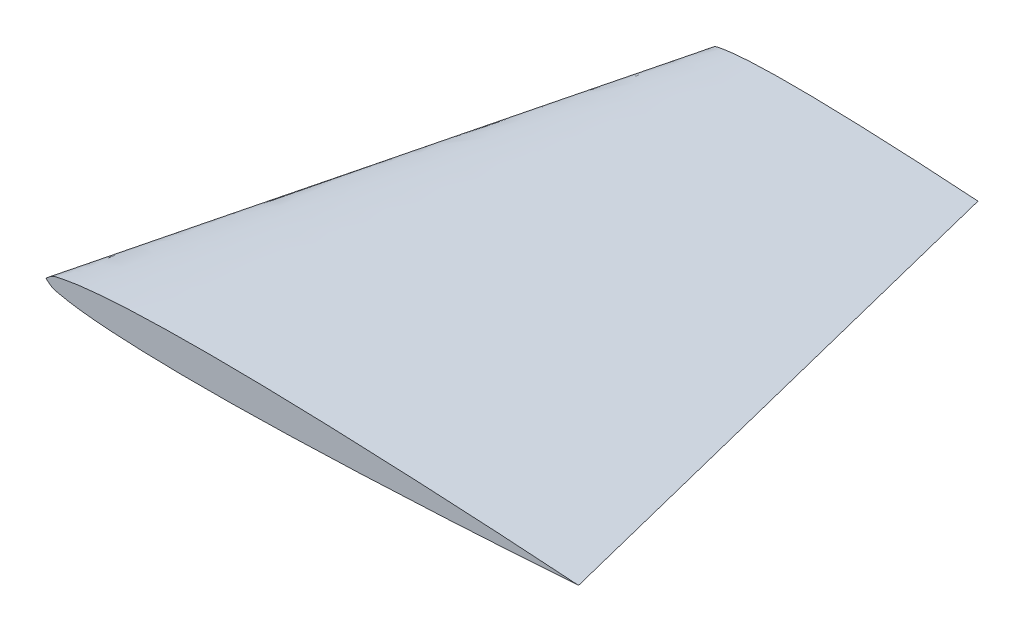
ISO-10303-21;
HEADER;
FILE_DESCRIPTION(('STEP AP214'),'2;1');
FILE_NAME('part.step','',(''),(''),'','','');
FILE_SCHEMA(('AUTOMOTIVE_DESIGN { 1 0 10303 214 1 1 1 1 }'));
ENDSEC;
DATA;
#1=APPLICATION_CONTEXT('core data for automotive mechanical design processes');
#2=APPLICATION_PROTOCOL_DEFINITION('international standard','automotive_design',2000,#1);
#3=PRODUCT_CONTEXT('',#1,'mechanical');
#4=PRODUCT('Part','Part','',(#3));
#5=PRODUCT_RELATED_PRODUCT_CATEGORY('part','',(#4));
#6=PRODUCT_DEFINITION_FORMATION('','',#4);
#7=PRODUCT_DEFINITION_CONTEXT('part definition',#1,'design');
#8=PRODUCT_DEFINITION('design','',#6,#7);
#9=PRODUCT_DEFINITION_SHAPE('','',#8);
#10=(LENGTH_UNIT() NAMED_UNIT(*) SI_UNIT(.MILLI.,.METRE.));
#11=(NAMED_UNIT(*) PLANE_ANGLE_UNIT() SI_UNIT($,.RADIAN.));
#12=(NAMED_UNIT(*) SI_UNIT($,.STERADIAN.) SOLID_ANGLE_UNIT());
#13=UNCERTAINTY_MEASURE_WITH_UNIT(LENGTH_MEASURE(1.E-05),#10,'distance_accuracy_value','');
#14=(GEOMETRIC_REPRESENTATION_CONTEXT(3) GLOBAL_UNCERTAINTY_ASSIGNED_CONTEXT((#13)) GLOBAL_UNIT_ASSIGNED_CONTEXT((#10,
#11,#12)) REPRESENTATION_CONTEXT('',''));
#15=CARTESIAN_POINT('',(0.,0.,0.));
#16=DIRECTION('',(0.,0.,1.));
#17=DIRECTION('',(1.,0.,0.));
#18=AXIS2_PLACEMENT_3D('',#15,#16,#17);
#19=CARTESIAN_POINT('',(12.6748974079118,0.340959353597855,-25.4));
#20=DIRECTION('',(0.,0.,-1.));
#21=DIRECTION('',(-1.,0.,0.));
#22=AXIS2_PLACEMENT_3D('',#19,#20,#21);
#23=PLANE('',#22);
#24=CARTESIAN_POINT('',(19.05,0.0120015,-25.4));
#25=CARTESIAN_POINT('',(18.8383446737176,0.026564659477958,-25.4));
#26=CARTESIAN_POINT('',(18.415086946658,0.0556873368407978,-25.4));
#27=CARTESIAN_POINT('',(17.1454504826109,0.136908300141959,-25.4));
#28=CARTESIAN_POINT('',(15.663846491236,0.218883802454526,-25.4));
#29=CARTESIAN_POINT('',(13.9702208806234,0.295590398675213,-25.4));
#30=CARTESIAN_POINT('',(12.7002162848019,0.342400747475957,-25.4));
#31=CARTESIAN_POINT('',(11.4301867211529,0.375783273830287,-25.4));
#32=CARTESIAN_POINT('',(10.3716840563293,0.387442448439419,-25.4));
#33=CARTESIAN_POINT('',(9.52494599929927,0.382828974564761,-25.4));
#34=CARTESIAN_POINT('',(8.889816149992,0.370294136111375,-25.4));
#35=CARTESIAN_POINT('',(8.25461654357095,0.346139204147698,-25.4));
#36=CARTESIAN_POINT('',(7.72512681650875,0.312565029501421,-25.4));
#37=CARTESIAN_POINT('',(7.30216950658663,0.271930618629846,-25.4));
#38=CARTESIAN_POINT('',(6.98277242838099,0.233618715714843,-25.4));
#39=CARTESIAN_POINT('',(6.72079803524755,0.180853938106343,-25.4));
#40=CARTESIAN_POINT('',(6.49114052756824,0.134181456566811,-25.4));
#41=CARTESIAN_POINT('',(6.39988212523975,0.0500092750214544,-25.4));
#42=CARTESIAN_POINT('',(6.35,0.0040005,-25.4));
#43=B_SPLINE_CURVE_WITH_KNOTS('',3,(#24,#25,#26,#27,#28,#29,#30,#31,#32,#33,#34,#35,#36,#37,#38,
#39,#40,#41,#42),.UNSPECIFIED.,.F.,.F.,(4,1,1,1,1,1,1,1,1,1,1,1,1,1,1,1,4),(0.,
0.0498491155189405,0.0996857660096569,0.298929011607979,0.39849819759761,0.498032959057188,
0.597533818547737,0.697007217925235,0.746742375654833,0.796486985804652,0.846259445485974,
0.896103225612024,0.92108563430274,0.946159455617349,0.971462222965117,0.984401162722593,1.),.UNSPECIFIED.);
#44=CARTESIAN_POINT('',(19.05,0.0120015,-25.4));
#45=VERTEX_POINT('',#44);
#46=CARTESIAN_POINT('',(6.35,0.0040005,-25.4));
#47=VERTEX_POINT('',#46);
#48=EDGE_CURVE('E51',#45,#47,#43,.T.);
#49=ORIENTED_EDGE('',*,*,#48,.F.);
#50=CARTESIAN_POINT('',(6.35,0.0040005,-25.4));
#51=CARTESIAN_POINT('',(6.39994005667686,-0.041945387046847,-25.4));
#52=CARTESIAN_POINT('',(6.49130444347111,-0.126002516235056,-25.4));
#53=CARTESIAN_POINT('',(6.72102057615176,-0.172385592381161,-25.4));
#54=CARTESIAN_POINT('',(6.9830612449234,-0.224820240500661,-25.4));
#55=CARTESIAN_POINT('',(7.30250634257026,-0.262729672844877,-25.4));
#56=CARTESIAN_POINT('',(7.72551451608638,-0.302831125461886,-25.4));
#57=CARTESIAN_POINT('',(8.25504612628306,-0.33573811666569,-25.4));
#58=CARTESIAN_POINT('',(8.89027566368506,-0.359092678268758,-25.4));
#59=CARTESIAN_POINT('',(9.52542080271664,-0.37082724347949,-25.4));
#60=CARTESIAN_POINT('',(10.3721640005811,-0.374373824163565,-25.4));
#61=CARTESIAN_POINT('',(11.4306511346114,-0.361380945981156,-25.4));
#62=CARTESIAN_POINT('',(12.7006376281448,-0.3263982095108,-25.4));
#63=CARTESIAN_POINT('',(13.9705822348209,-0.277987692712483,-25.4));
#64=CARTESIAN_POINT('',(15.6641098507613,-0.199147189959067,-25.4));
#65=CARTESIAN_POINT('',(17.1456093769475,-0.115304932430437,-25.4));
#66=CARTESIAN_POINT('',(18.4151424947843,-0.0324842922926891,-25.4));
#67=CARTESIAN_POINT('',(18.8383631913032,-0.00282833352299483,-25.4));
#68=CARTESIAN_POINT('',(19.05,0.0120015,-25.4));
#69=B_SPLINE_CURVE_WITH_KNOTS('',3,(#50,#51,#52,#53,#54,#55,#56,#57,#58,#59,#60,#61,#62,#63,#64,
#65,#66,#67,#68),.UNSPECIFIED.,.F.,.F.,(4,1,1,1,1,1,1,1,1,1,1,1,1,1,1,1,4),(0.,
0.0155988372774071,0.0285377770348835,0.0538405443826511,0.07891436569726,0.103896774387976,
0.153740554514026,0.203513014195348,0.253257624345167,0.302992782074765,0.402466181452263,
0.501967040942812,0.60150180240239,0.701070988392021,0.900314233990343,0.950150884481059,1.),.UNSPECIFIED.);
#70=EDGE_CURVE('E11',#47,#45,#69,.T.);
#71=ORIENTED_EDGE('',*,*,#70,.F.);
#72=EDGE_LOOP('',(#49,#71));
#73=FACE_BOUND('',#72,.T.);
#74=ADVANCED_FACE('F41',(#73),#23,.T.);
#75=CARTESIAN_POINT('',(12.6506339103945,-0.657978437098193,0.));
#76=DIRECTION('',(0.,0.,1.));
#77=DIRECTION('',(1.,0.,0.));
#78=AXIS2_PLACEMENT_3D('',#75,#76,#77);
#79=PLANE('',#78);
#80=CARTESIAN_POINT('',(0.,0.,0.));
#81=CARTESIAN_POINT('',(0.0998801133537167,-0.0918917740936939,0.));
#82=CARTESIAN_POINT('',(0.282608886942222,-0.260006032470112,0.));
#83=CARTESIAN_POINT('',(0.742041152303517,-0.352772184762323,0.));
#84=CARTESIAN_POINT('',(1.26612248984681,-0.457641481001323,0.));
#85=CARTESIAN_POINT('',(1.90501268514052,-0.533460345689754,0.));
#86=CARTESIAN_POINT('',(2.75102903217276,-0.613663250923771,0.));
#87=CARTESIAN_POINT('',(3.81009225256612,-0.67947723333138,0.));
#88=CARTESIAN_POINT('',(5.08055132737012,-0.726186356537516,0.));
#89=CARTESIAN_POINT('',(6.35084160543328,-0.749655486958981,0.));
#90=CARTESIAN_POINT('',(8.04432800116212,-0.756748648327131,0.));
#91=CARTESIAN_POINT('',(10.1613022692228,-0.730762891962312,0.));
#92=CARTESIAN_POINT('',(12.7012752562895,-0.660797419021601,0.));
#93=CARTESIAN_POINT('',(15.2411644696419,-0.563976385424965,0.));
#94=CARTESIAN_POINT('',(17.7810007262782,-0.445736821156993,0.));
#95=CARTESIAN_POINT('',(20.3208837788568,-0.310494645980327,0.));
#96=CARTESIAN_POINT('',(22.4372336618177,-0.183419318255436,0.));
#97=CARTESIAN_POINT('',(24.1302849895687,-0.0729695845853782,0.));
#98=CARTESIAN_POINT('',(24.9767263826065,-0.0136576670459897,0.));
#99=CARTESIAN_POINT('',(25.4,0.016002,0.));
#100=B_SPLINE_CURVE_WITH_KNOTS('',3,(#80,#81,#82,#83,#84,#85,#86,#87,#88,#89,#90,#91,#92,#93,
#94,#95,#96,#97,#98,#99),.UNSPECIFIED.,.F.,.F.,(4,1,1,1,1,1,1,1,1,1,1,1,1,1,1,1,1,4),(0.,
0.0155988372774071,0.0285377770348835,0.0538405443826511,0.07891436569726,0.103896774387976,
0.153740554514026,0.203513014195348,0.253257624345167,0.302992782074765,0.402466181452263,
0.501967040942812,0.60150180240239,0.701070988392021,0.800673904092982,0.900314233990343,
0.950150884481059,1.),.UNSPECIFIED.);
#101=CARTESIAN_POINT('',(0.,0.,0.));
#102=VERTEX_POINT('',#101);
#103=CARTESIAN_POINT('',(25.4,0.016002,0.));
#104=VERTEX_POINT('',#103);
#105=EDGE_CURVE('E72',#102,#104,#100,.T.);
#106=ORIENTED_EDGE('',*,*,#105,.T.);
#107=CARTESIAN_POINT('',(25.4,0.016002,0.));
#108=CARTESIAN_POINT('',(24.9766893474353,0.045128318955916,0.));
#109=CARTESIAN_POINT('',(24.130173893316,0.103373673681596,0.));
#110=CARTESIAN_POINT('',(22.4369847428994,0.211690075850408,0.));
#111=CARTESIAN_POINT('',(20.320476425047,0.336098702908787,0.));
#112=CARTESIAN_POINT('',(17.7804249835537,0.468140519354187,0.));
#113=CARTESIAN_POINT('',(15.2404417612467,0.583179797350425,0.));
#114=CARTESIAN_POINT('',(12.7004325696037,0.676800494951913,0.));
#115=CARTESIAN_POINT('',(10.1603734423059,0.743565547660575,0.));
#116=CARTESIAN_POINT('',(8.04336811265864,0.766883896878838,0.));
#117=CARTESIAN_POINT('',(6.34989199859855,0.757656949129521,0.));
#118=CARTESIAN_POINT('',(5.079632299984,0.732587272222749,0.));
#119=CARTESIAN_POINT('',(3.8092330871419,0.684277408295396,0.));
#120=CARTESIAN_POINT('',(2.75025363301751,0.617129059002841,0.));
#121=CARTESIAN_POINT('',(1.90433901317326,0.535860237259691,0.));
#122=CARTESIAN_POINT('',(1.26554485676197,0.459236431429686,0.));
#123=CARTESIAN_POINT('',(0.741596070495102,0.353706876212686,0.));
#124=CARTESIAN_POINT('',(0.282281055136491,0.260361913133622,0.));
#125=CARTESIAN_POINT('',(0.0997642504795106,0.0920175500429088,0.));
#126=CARTESIAN_POINT('',(0.,0.,0.));
#127=B_SPLINE_CURVE_WITH_KNOTS('',3,(#107,#108,#109,#110,#111,#112,#113,#114,#115,#116,#117,
#118,#119,#120,#121,#122,#123,#124,#125,#126),.UNSPECIFIED.,.F.,.F.,(4,1,1,1,1,1,1,1,1,1,1,1,1,
1,1,1,1,4),(0.,0.0498491155189405,0.0996857660096569,0.199326095907018,0.298929011607979,
0.39849819759761,0.498032959057188,0.597533818547737,0.697007217925235,0.746742375654833,
0.796486985804652,0.846259445485974,0.896103225612024,0.92108563430274,0.946159455617349,
0.971462222965117,0.984401162722593,1.),.UNSPECIFIED.);
#128=EDGE_CURVE('E76',#104,#102,#127,.T.);
#129=ORIENTED_EDGE('',*,*,#128,.T.);
#130=EDGE_LOOP('',(#106,#129));
#131=FACE_BOUND('',#130,.T.);
#132=ADVANCED_FACE('F82',(#131),#79,.T.);
#133=CARTESIAN_POINT('',(25.4,0.016002,0.));
#134=CARTESIAN_POINT('',(19.05,0.0120015,-25.4));
#135=CARTESIAN_POINT('',(24.9767263826065,-0.0136576670459897,0.));
#136=CARTESIAN_POINT('',(18.8383631913032,-0.00282833352299483,-25.4));
#137=CARTESIAN_POINT('',(24.1302849895687,-0.0729695845853782,0.));
#138=CARTESIAN_POINT('',(18.4151424947843,-0.0324842922926891,-25.4));
#139=CARTESIAN_POINT('',(22.4372336618177,-0.183419318255436,0.));
#140=CARTESIAN_POINT('',(17.5686168309088,-0.0877091591277181,-25.4));
#141=CARTESIAN_POINT('',(20.3208837788568,-0.310494645980327,0.));
#142=CARTESIAN_POINT('',(16.5104432830046,-0.151250782078398,-25.4));
#143=CARTESIAN_POINT('',(17.7810007262782,-0.445736821156993,0.));
#144=CARTESIAN_POINT('',(15.2405003631391,-0.218867910578496,-25.4));
#145=CARTESIAN_POINT('',(15.2411644696419,-0.563976385424965,0.));
#146=CARTESIAN_POINT('',(13.9705822348209,-0.277987692712483,-25.4));
#147=CARTESIAN_POINT('',(12.7012752562895,-0.660797419021601,0.));
#148=CARTESIAN_POINT('',(12.7006376281448,-0.3263982095108,-25.4));
#149=CARTESIAN_POINT('',(10.1613022692228,-0.730762891962312,0.));
#150=CARTESIAN_POINT('',(11.4306511346114,-0.361380945981156,-25.4));
#151=CARTESIAN_POINT('',(8.04432800116212,-0.756748648327131,0.));
#152=CARTESIAN_POINT('',(10.3721640005811,-0.374373824163565,-25.4));
#153=CARTESIAN_POINT('',(6.35084160543328,-0.749655486958981,0.));
#154=CARTESIAN_POINT('',(9.52542080271664,-0.37082724347949,-25.4));
#155=CARTESIAN_POINT('',(5.08055132737012,-0.726186356537516,0.));
#156=CARTESIAN_POINT('',(8.89027566368506,-0.359092678268758,-25.4));
#157=CARTESIAN_POINT('',(3.81009225256612,-0.67947723333138,0.));
#158=CARTESIAN_POINT('',(8.25504612628306,-0.33573811666569,-25.4));
#159=CARTESIAN_POINT('',(2.75102903217276,-0.613663250923771,0.));
#160=CARTESIAN_POINT('',(7.72551451608638,-0.302831125461886,-25.4));
#161=CARTESIAN_POINT('',(1.90501268514052,-0.533460345689754,0.));
#162=CARTESIAN_POINT('',(7.30250634257026,-0.262729672844877,-25.4));
#163=CARTESIAN_POINT('',(1.26612248984681,-0.457641481001323,0.));
#164=CARTESIAN_POINT('',(6.9830612449234,-0.224820240500661,-25.4));
#165=CARTESIAN_POINT('',(0.742041152303517,-0.352772184762323,0.));
#166=CARTESIAN_POINT('',(6.72102057615176,-0.172385592381161,-25.4));
#167=CARTESIAN_POINT('',(0.282608886942222,-0.260006032470112,0.));
#168=CARTESIAN_POINT('',(6.49130444347111,-0.126002516235056,-25.4));
#169=CARTESIAN_POINT('',(0.0998801133537167,-0.0918917740936939,0.));
#170=CARTESIAN_POINT('',(6.39994005667686,-0.041945387046847,-25.4));
#171=CARTESIAN_POINT('',(0.,0.,0.));
#172=CARTESIAN_POINT('',(6.35,0.0040005,-25.4));
#173=B_SPLINE_SURFACE_WITH_KNOTS('',3,1,((#133,#134),(#135,#136),(#137,#138),(#139,#140),(#141,
#142),(#143,#144),(#145,#146),(#147,#148),(#149,#150),(#151,#152),(#153,#154),(#155,#156),(#157,
#158),(#159,#160),(#161,#162),(#163,#164),(#165,#166),(#167,#168),(#169,#170),(#171,#172)),
.UNSPECIFIED.,.F.,.F.,.F.,(4,1,1,1,1,1,1,1,1,1,1,1,1,1,1,1,1,4),(2,2),(0.,0.0498491155189406,
0.0996857660096568,0.199326095907018,0.298929011607979,0.39849819759761,0.498032959057188,
0.597533818547737,0.697007217925235,0.746742375654833,0.796486985804652,0.846259445485974,
0.896103225612024,0.92108563430274,0.946159455617349,0.971462222965117,0.984401162722593,1.),
(0.,1.),.UNSPECIFIED.);
#174=DIRECTION('',(0.242535622205086,0.000152797441989204,-0.970142488820345));
#175=VECTOR('',#174,1.);
#176=CARTESIAN_POINT('',(3.175,0.00200025,-12.7));
#177=LINE('',#176,#175);
#178=EDGE_CURVE('E75',#102,#47,#177,.T.);
#179=DIRECTION('',(0.242535622205086,0.000152797441989204,0.970142488820345));
#180=VECTOR('',#179,1.);
#181=CARTESIAN_POINT('',(22.225,0.01400175,-12.7));
#182=LINE('',#181,#180);
#183=EDGE_CURVE('E62',#45,#104,#182,.T.);
#184=ORIENTED_EDGE('',*,*,#105,.F.);
#185=ORIENTED_EDGE('',*,*,#178,.T.);
#186=ORIENTED_EDGE('',*,*,#70,.T.);
#187=ORIENTED_EDGE('',*,*,#183,.T.);
#188=EDGE_LOOP('',(#184,#185,#186,#187));
#189=FACE_BOUND('',#188,.T.);
#190=ADVANCED_FACE('F69',(#189),#173,.T.);
#191=CARTESIAN_POINT('',(0.,0.,0.));
#192=CARTESIAN_POINT('',(6.35,0.0040005,-25.4));
#193=CARTESIAN_POINT('',(0.0997642504795106,0.0920175500429088,0.));
#194=CARTESIAN_POINT('',(6.39988212523975,0.0500092750214544,-25.4));
#195=CARTESIAN_POINT('',(0.282281055136491,0.260361913133622,0.));
#196=CARTESIAN_POINT('',(6.49114052756824,0.134181456566811,-25.4));
#197=CARTESIAN_POINT('',(0.741596070495102,0.353706876212686,0.));
#198=CARTESIAN_POINT('',(6.72079803524755,0.180853938106343,-25.4));
#199=CARTESIAN_POINT('',(1.26554485676197,0.459236431429686,0.));
#200=CARTESIAN_POINT('',(6.98277242838099,0.233618715714843,-25.4));
#201=CARTESIAN_POINT('',(1.90433901317326,0.535860237259691,0.));
#202=CARTESIAN_POINT('',(7.30216950658663,0.271930618629846,-25.4));
#203=CARTESIAN_POINT('',(2.75025363301751,0.617129059002841,0.));
#204=CARTESIAN_POINT('',(7.72512681650875,0.312565029501421,-25.4));
#205=CARTESIAN_POINT('',(3.8092330871419,0.684277408295396,0.));
#206=CARTESIAN_POINT('',(8.25461654357095,0.346139204147698,-25.4));
#207=CARTESIAN_POINT('',(5.079632299984,0.732587272222749,0.));
#208=CARTESIAN_POINT('',(8.889816149992,0.370294136111375,-25.4));
#209=CARTESIAN_POINT('',(6.34989199859855,0.757656949129521,0.));
#210=CARTESIAN_POINT('',(9.52494599929927,0.382828974564761,-25.4));
#211=CARTESIAN_POINT('',(8.04336811265864,0.766883896878838,0.));
#212=CARTESIAN_POINT('',(10.3716840563293,0.387442448439419,-25.4));
#213=CARTESIAN_POINT('',(10.1603734423059,0.743565547660575,0.));
#214=CARTESIAN_POINT('',(11.4301867211529,0.375783273830287,-25.4));
#215=CARTESIAN_POINT('',(12.7004325696037,0.676800494951913,0.));
#216=CARTESIAN_POINT('',(12.7002162848019,0.342400747475957,-25.4));
#217=CARTESIAN_POINT('',(15.2404417612467,0.583179797350425,0.));
#218=CARTESIAN_POINT('',(13.9702208806234,0.295590398675213,-25.4));
#219=CARTESIAN_POINT('',(17.7804249835537,0.468140519354187,0.));
#220=CARTESIAN_POINT('',(15.2402124917769,0.238070759677093,-25.4));
#221=CARTESIAN_POINT('',(20.320476425047,0.336098702908787,0.));
#222=CARTESIAN_POINT('',(16.5102396011101,0.17205381229539,-25.4));
#223=CARTESIAN_POINT('',(22.4369847428994,0.211690075850408,0.));
#224=CARTESIAN_POINT('',(17.5684923714497,0.109845537925204,-25.4));
#225=CARTESIAN_POINT('',(24.130173893316,0.103373673681596,0.));
#226=CARTESIAN_POINT('',(18.415086946658,0.0556873368407978,-25.4));
#227=CARTESIAN_POINT('',(24.9766893474353,0.045128318955916,0.));
#228=CARTESIAN_POINT('',(18.8383446737176,0.026564659477958,-25.4));
#229=CARTESIAN_POINT('',(25.4,0.016002,0.));
#230=CARTESIAN_POINT('',(19.05,0.0120015,-25.4));
#231=B_SPLINE_SURFACE_WITH_KNOTS('',3,1,((#191,#192),(#193,#194),(#195,#196),(#197,#198),(#199,
#200),(#201,#202),(#203,#204),(#205,#206),(#207,#208),(#209,#210),(#211,#212),(#213,#214),(#215,
#216),(#217,#218),(#219,#220),(#221,#222),(#223,#224),(#225,#226),(#227,#228),(#229,#230)),
.UNSPECIFIED.,.F.,.F.,.F.,(4,1,1,1,1,1,1,1,1,1,1,1,1,1,1,1,1,4),(2,2),(0.,0.0155988372774071,
0.0285377770348835,0.0538405443826511,0.07891436569726,0.103896774387976,0.153740554514026,
0.203513014195348,0.253257624345167,0.302992782074765,0.402466181452263,0.501967040942812,
0.60150180240239,0.701070988392021,0.800673904092982,0.900314233990343,0.950150884481059,1.),
(0.,1.),.UNSPECIFIED.);
#232=ORIENTED_EDGE('',*,*,#128,.F.);
#233=ORIENTED_EDGE('',*,*,#183,.F.);
#234=ORIENTED_EDGE('',*,*,#48,.T.);
#235=ORIENTED_EDGE('',*,*,#178,.F.);
#236=EDGE_LOOP('',(#232,#233,#234,#235));
#237=FACE_BOUND('',#236,.T.);
#238=ADVANCED_FACE('F78',(#237),#231,.T.);
#239=CLOSED_SHELL('',(#74,#132,#190,#238));
#240=MANIFOLD_SOLID_BREP('B2',#239);
#241=ADVANCED_BREP_SHAPE_REPRESENTATION('',(#18,#240),#14);
#242=SHAPE_DEFINITION_REPRESENTATION(#9,#241);
ENDSEC;
END-ISO-10303-21;
